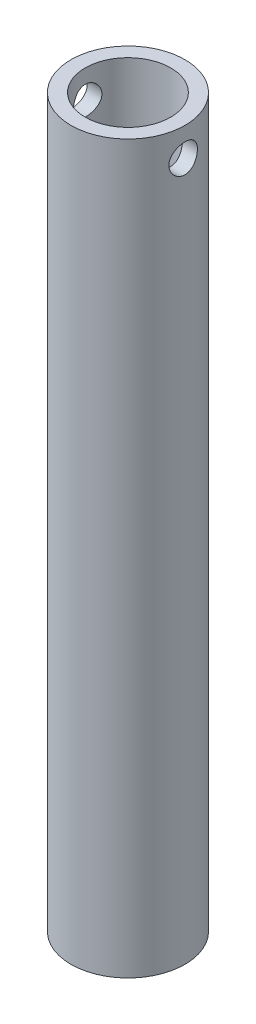
ISO-10303-21;
HEADER;
FILE_DESCRIPTION(('STEP AP214'),'2;1');
FILE_NAME('part.step','',(''),(''),'','','');
FILE_SCHEMA(('AUTOMOTIVE_DESIGN { 1 0 10303 214 1 1 1 1 }'));
ENDSEC;
DATA;
#1=APPLICATION_CONTEXT('core data for automotive mechanical design processes');
#2=APPLICATION_PROTOCOL_DEFINITION('international standard','automotive_design',2000,#1);
#3=PRODUCT_CONTEXT('',#1,'mechanical');
#4=PRODUCT('Part','Part','',(#3));
#5=PRODUCT_RELATED_PRODUCT_CATEGORY('part','',(#4));
#6=PRODUCT_DEFINITION_FORMATION('','',#4);
#7=PRODUCT_DEFINITION_CONTEXT('part definition',#1,'design');
#8=PRODUCT_DEFINITION('design','',#6,#7);
#9=PRODUCT_DEFINITION_SHAPE('','',#8);
#10=(LENGTH_UNIT() NAMED_UNIT(*) SI_UNIT(.MILLI.,.METRE.));
#11=(NAMED_UNIT(*) PLANE_ANGLE_UNIT() SI_UNIT($,.RADIAN.));
#12=(NAMED_UNIT(*) SI_UNIT($,.STERADIAN.) SOLID_ANGLE_UNIT());
#13=UNCERTAINTY_MEASURE_WITH_UNIT(LENGTH_MEASURE(1.E-05),#10,'distance_accuracy_value','');
#14=(GEOMETRIC_REPRESENTATION_CONTEXT(3) GLOBAL_UNCERTAINTY_ASSIGNED_CONTEXT((#13)) GLOBAL_UNIT_ASSIGNED_CONTEXT((#10,
#11,#12)) REPRESENTATION_CONTEXT('',''));
#15=CARTESIAN_POINT('',(0.,0.,0.));
#16=DIRECTION('',(0.,0.,1.));
#17=DIRECTION('',(1.,0.,0.));
#18=AXIS2_PLACEMENT_3D('',#15,#16,#17);
#19=CARTESIAN_POINT('',(0.,161.925,0.));
#20=DIRECTION('',(0.,1.,0.));
#21=DIRECTION('',(0.,0.,1.));
#22=AXIS2_PLACEMENT_3D('',#19,#20,#21);
#23=PLANE('',#22);
#24=CARTESIAN_POINT('',(0.,161.925,0.));
#25=DIRECTION('',(0.,1.,0.));
#26=DIRECTION('',(0.,0.,1.));
#27=AXIS2_PLACEMENT_3D('',#24,#25,#26);
#28=CIRCLE('',#27,12.7);
#29=CARTESIAN_POINT('',(0.,161.925,12.7));
#30=VERTEX_POINT('',#29);
#31=EDGE_CURVE('E10',#30,#30,#28,.T.);
#32=ORIENTED_EDGE('',*,*,#31,.T.);
#33=EDGE_LOOP('',(#32));
#34=FACE_BOUND('',#33,.T.);
#35=CARTESIAN_POINT('',(0.,161.925,0.));
#36=DIRECTION('',(0.,1.,0.));
#37=DIRECTION('',(0.,0.,1.));
#38=AXIS2_PLACEMENT_3D('',#35,#36,#37);
#39=CIRCLE('',#38,9.525);
#40=CARTESIAN_POINT('',(0.,161.925,9.525));
#41=VERTEX_POINT('',#40);
#42=EDGE_CURVE('E50',#41,#41,#39,.T.);
#43=ORIENTED_EDGE('',*,*,#42,.F.);
#44=EDGE_LOOP('',(#43));
#45=FACE_BOUND('',#44,.T.);
#46=ADVANCED_FACE('F32',(#34,#45),#23,.T.);
#47=CARTESIAN_POINT('',(0.,0.,0.));
#48=DIRECTION('',(0.,1.,0.));
#49=DIRECTION('',(0.,0.,1.));
#50=AXIS2_PLACEMENT_3D('',#47,#48,#49);
#51=PLANE('',#50);
#52=CARTESIAN_POINT('',(0.,0.,0.));
#53=DIRECTION('',(0.,1.,0.));
#54=DIRECTION('',(0.,0.,1.));
#55=AXIS2_PLACEMENT_3D('',#52,#53,#54);
#56=CIRCLE('',#55,12.7);
#57=CARTESIAN_POINT('',(0.,0.,12.7));
#58=VERTEX_POINT('',#57);
#59=EDGE_CURVE('E45',#58,#58,#56,.T.);
#60=ORIENTED_EDGE('',*,*,#59,.F.);
#61=EDGE_LOOP('',(#60));
#62=FACE_BOUND('',#61,.T.);
#63=CARTESIAN_POINT('',(0.,0.,0.));
#64=DIRECTION('',(0.,1.,0.));
#65=DIRECTION('',(0.,0.,1.));
#66=AXIS2_PLACEMENT_3D('',#63,#64,#65);
#67=CIRCLE('',#66,9.525);
#68=CARTESIAN_POINT('',(0.,0.,9.525));
#69=VERTEX_POINT('',#68);
#70=EDGE_CURVE('E53',#69,#69,#67,.T.);
#71=ORIENTED_EDGE('',*,*,#70,.T.);
#72=EDGE_LOOP('',(#71));
#73=FACE_BOUND('',#72,.T.);
#74=ADVANCED_FACE('F86',(#62,#73),#51,.F.);
#75=CARTESIAN_POINT('',(0.,161.925,0.));
#76=DIRECTION('',(0.,-1.,0.));
#77=DIRECTION('',(0.,0.,-1.));
#78=AXIS2_PLACEMENT_3D('',#75,#76,#77);
#79=CYLINDRICAL_SURFACE('',#78,12.7);
#80=CARTESIAN_POINT('',(-12.7,152.4,0.));
#81=CARTESIAN_POINT('',(-12.6999970338729,152.400004922812,-0.175421054350931));
#82=CARTESIAN_POINT('',(-12.6963292371237,152.414587115805,-0.350897100741782));
#83=CARTESIAN_POINT('',(-12.6820530760661,152.472443236933,-0.696820051980961));
#84=CARTESIAN_POINT('',(-12.6714407780562,152.515733426855,-0.867264049209733));
#85=CARTESIAN_POINT('',(-12.6444507573613,152.629529753161,-1.19807751278646));
#86=CARTESIAN_POINT('',(-12.6280799601569,152.700003207281,-1.35845880926017));
#87=CARTESIAN_POINT('',(-12.591316443928,152.866050608928,-1.66512267919771));
#88=CARTESIAN_POINT('',(-12.5709235892463,152.961625403118,-1.81140477687155));
#89=CARTESIAN_POINT('',(-12.5278602543575,153.177241671435,-2.08873074612027));
#90=CARTESIAN_POINT('',(-12.5051546346353,153.297702833663,-2.2194428772959));
#91=CARTESIAN_POINT('',(-12.4602582924963,153.558773833724,-2.45903522924702));
#92=CARTESIAN_POINT('',(-12.4380676284689,153.699385943571,-2.56791298487579));
#93=CARTESIAN_POINT('',(-12.3963594189446,153.999343229927,-2.76230618225783));
#94=CARTESIAN_POINT('',(-12.3768864828385,154.158935671878,-2.84745052370821));
#95=CARTESIAN_POINT('',(-12.343330973648,154.490734138014,-2.9895734564324));
#96=CARTESIAN_POINT('',(-12.3292475388652,154.662938140553,-3.04655655068163));
#97=CARTESIAN_POINT('',(-12.3084267567388,155.01142373786,-3.12960773790342));
#98=CARTESIAN_POINT('',(-12.3015478927701,155.187554529947,-3.15627230130284));
#99=CARTESIAN_POINT('',(-12.2954915053947,155.541913471049,-3.17978742389056));
#100=CARTESIAN_POINT('',(-12.2963127290578,155.720141274132,-3.176642833515));
#101=CARTESIAN_POINT('',(-12.3054365167726,156.069063459728,-3.14110481048737));
#102=CARTESIAN_POINT('',(-12.3135572669877,156.239835732102,-3.1094221534035));
#103=CARTESIAN_POINT('',(-12.3360753547043,156.573560891095,-3.01884119561133));
#104=CARTESIAN_POINT('',(-12.3504731393489,156.736513219745,-2.95994095604687));
#105=CARTESIAN_POINT('',(-12.3840899110031,157.051878801067,-2.81599106163371));
#106=CARTESIAN_POINT('',(-12.4033560981111,157.204169063621,-2.73068344564301));
#107=CARTESIAN_POINT('',(-12.4445122129068,157.492527935652,-2.53652078423163));
#108=CARTESIAN_POINT('',(-12.4664025994163,157.628593700076,-2.42766161831203));
#109=CARTESIAN_POINT('',(-12.5111061380944,157.884714319886,-2.18580424890856));
#110=CARTESIAN_POINT('',(-12.533927803951,158.004202003963,-2.05220624645105));
#111=CARTESIAN_POINT('',(-12.5773596047503,158.219184963215,-1.76659522538281));
#112=CARTESIAN_POINT('',(-12.5979696721291,158.314679505525,-1.6145816444818));
#113=CARTESIAN_POINT('',(-12.6347586626604,158.479173740842,-1.29564529770894));
#114=CARTESIAN_POINT('',(-12.6509221227036,158.548081303539,-1.12867311562491));
#115=CARTESIAN_POINT('',(-12.676884242985,158.656691630419,-0.785020883902428));
#116=CARTESIAN_POINT('',(-12.6866841206814,158.696399981085,-0.608342698201852));
#117=CARTESIAN_POINT('',(-12.6986347345774,158.744618513766,-0.255142937325549));
#118=CARTESIAN_POINT('',(-12.7009747992585,158.753901071859,-0.0787330573083703));
#119=CARTESIAN_POINT('',(-12.6982813685726,158.743122945649,0.273119584996531));
#120=CARTESIAN_POINT('',(-12.6932485369526,158.723064902742,0.448562432914398));
#121=CARTESIAN_POINT('',(-12.6764961338622,158.654811577238,0.790816868910241));
#122=CARTESIAN_POINT('',(-12.6648767569325,158.607037658974,0.957717835150525));
#123=CARTESIAN_POINT('',(-12.6362609570897,158.485190005473,1.28112793569116));
#124=CARTESIAN_POINT('',(-12.6192639911647,158.411113614204,1.43763601861911));
#125=CARTESIAN_POINT('',(-12.5813250177716,158.237266860549,1.73889063454314));
#126=CARTESIAN_POINT('',(-12.5603183592593,158.137063895427,1.88337918521904));
#127=CARTESIAN_POINT('',(-12.5167921111412,157.914361359713,2.15376466554501));
#128=CARTESIAN_POINT('',(-12.4942722608556,157.791857941143,2.27965837982672));
#129=CARTESIAN_POINT('',(-12.4495762556412,157.524445849547,2.51246336908675));
#130=CARTESIAN_POINT('',(-12.4274221051899,157.379061028651,2.6188328531313));
#131=CARTESIAN_POINT('',(-12.3865825924258,157.072049257042,2.80566443991221));
#132=CARTESIAN_POINT('',(-12.3678970761538,156.910423027713,2.88612769264177));
#133=CARTESIAN_POINT('',(-12.3363163381503,156.576382887573,3.0182638402854));
#134=CARTESIAN_POINT('',(-12.3233869021911,156.404039853404,3.07010730622842));
#135=CARTESIAN_POINT('',(-12.3047494152553,156.052711266541,3.1439816468797));
#136=CARTESIAN_POINT('',(-12.299039785006,155.873727175344,3.16601904149253));
#137=CARTESIAN_POINT('',(-12.2956087422145,155.51971049948,3.17931501621074));
#138=CARTESIAN_POINT('',(-12.2976625750886,155.344712095613,3.17143955029538));
#139=CARTESIAN_POINT('',(-12.3090074061494,154.998623435624,3.1271152390873));
#140=CARTESIAN_POINT('',(-12.3182982588945,154.827533101033,3.09066696801937));
#141=CARTESIAN_POINT('',(-12.3429450180984,154.495058761656,2.99070462615689));
#142=CARTESIAN_POINT('',(-12.3582644892528,154.333623037245,2.92735297324092));
#143=CARTESIAN_POINT('',(-12.3932474960913,154.023556606586,2.77551073379659));
#144=CARTESIAN_POINT('',(-12.4129116342002,153.874927680087,2.68701666057214));
#145=CARTESIAN_POINT('',(-12.4550092586011,153.590509368613,2.48468673461549));
#146=CARTESIAN_POINT('',(-12.4775016056118,153.455156061253,2.37025002816432));
#147=CARTESIAN_POINT('',(-12.5223699100401,153.205292088516,2.12045416901819));
#148=CARTESIAN_POINT('',(-12.5447458385544,153.090786379594,1.98509005500273));
#149=CARTESIAN_POINT('',(-12.5873437112106,152.883846063538,1.69432305852049));
#150=CARTESIAN_POINT('',(-12.6075193062447,152.791848734395,1.53860166056968));
#151=CARTESIAN_POINT('',(-12.6429542453062,152.635484536776,1.21341315929717));
#152=CARTESIAN_POINT('',(-12.6582171100619,152.571097869961,1.04395600927443));
#153=CARTESIAN_POINT('',(-12.6798505941374,152.481339625802,0.729001702698686));
#154=CARTESIAN_POINT('',(-12.6873547169486,152.450903202204,0.58500469508875));
#155=CARTESIAN_POINT('',(-12.6974304774096,152.410232086,0.29401785141847));
#156=CARTESIAN_POINT('',(-12.7000024860439,152.39999587397,0.147028241296873));
#157=CARTESIAN_POINT('',(-12.7,152.4,0.));
#158=B_SPLINE_CURVE_WITH_KNOTS('',3,(#80,#81,#82,#83,#84,#85,#86,#87,#88,#89,#90,#91,#92,#93,
#94,#95,#96,#97,#98,#99,#100,#101,#102,#103,#104,#105,#106,#107,#108,#109,#110,#111,#112,#113,
#114,#115,#116,#117,#118,#119,#120,#121,#122,#123,#124,#125,#126,#127,#128,#129,#130,#131,#132,
#133,#134,#135,#136,#137,#138,#139,#140,#141,#142,#143,#144,#145,#146,#147,#148,#149,#150,#151,
#152,#153,#154,#155,#156,#157),.UNSPECIFIED.,.T.,.F.,(4,2,2,2,2,2,2,2,2,2,2,2,2,2,2,2,2,2,2,2,2,
2,2,2,2,2,2,2,2,2,2,2,2,2,2,2,2,2,4),(0.,0.525724358065498,1.05174676993359,1.57713870983893,
2.10254837335841,2.63767221675278,3.17285644277796,3.7159913730529,4.25903942808498,
4.79120824630598,5.3232904734557,5.84247618671886,6.36169889010144,6.8861628400674,
7.41071862276906,7.95023177058124,8.48976139571985,9.0311441807632,9.57242335981323,
10.09985087283,10.6272309069567,11.1467958106174,11.6664131950588,12.1952509368702,
12.7241800170733,13.266092111565,13.8079801469349,14.34660272276,14.885107458967,
15.4081433519175,15.9311687337377,16.4510804786766,16.971064359066,17.5046127008448,
18.0382877269755,18.5816279265762,19.1245778677202,19.5652441424438,20.005877269746),.UNSPECIFIED.);
#159=CARTESIAN_POINT('',(-12.7,152.4,0.));
#160=VERTEX_POINT('',#159);
#161=EDGE_CURVE('E76',#160,#160,#158,.T.);
#162=ORIENTED_EDGE('',*,*,#161,.T.);
#163=EDGE_LOOP('',(#162));
#164=FACE_BOUND('',#163,.T.);
#165=CARTESIAN_POINT('',(12.2967221242086,155.575,-3.175));
#166=CARTESIAN_POINT('',(12.2967254711158,155.399675546323,-3.1749950198132));
#167=CARTESIAN_POINT('',(12.3005126863854,155.224295978678,-3.16042833178201));
#168=CARTESIAN_POINT('',(12.3152136473056,154.87857317572,-3.10263936933901));
#169=CARTESIAN_POINT('',(12.3261315404947,154.708232931825,-3.05940041756247));
#170=CARTESIAN_POINT('',(12.3537818023711,154.377639506502,-2.94575382353269));
#171=CARTESIAN_POINT('',(12.3705066621688,154.21737361266,-2.8753812543752));
#172=CARTESIAN_POINT('',(12.4078770387652,153.910905217274,-2.70957184940195));
#173=CARTESIAN_POINT('',(12.4285227220068,153.764703313158,-2.61413394947206));
#174=CARTESIAN_POINT('',(12.4719170977164,153.487295710517,-2.39865970268607));
#175=CARTESIAN_POINT('',(12.4946993898125,153.356445127555,-2.27817284738413));
#176=CARTESIAN_POINT('',(12.5395085190442,153.116583029162,-2.01699122140783));
#177=CARTESIAN_POINT('',(12.5615352853931,153.00757355546,-1.87629456360899));
#178=CARTESIAN_POINT('',(12.6027232771114,152.813035156108,-1.57625440537027));
#179=CARTESIAN_POINT('',(12.6218402299875,152.727855087035,-1.4166781117678));
#180=CARTESIAN_POINT('',(12.65467131146,152.585661751926,-1.08491424405179));
#181=CARTESIAN_POINT('',(12.6683862371462,152.528644330067,-0.912728534955745));
#182=CARTESIAN_POINT('',(12.6886304373719,152.445532250085,-0.564335623617766));
#183=CARTESIAN_POINT('',(12.6952996518228,152.418834551705,-0.388280553827183));
#184=CARTESIAN_POINT('',(12.7011886451627,152.39522685832,-0.0340726004637068));
#185=CARTESIAN_POINT('',(12.7004095254281,152.398312459294,0.144079969063354));
#186=CARTESIAN_POINT('',(12.6915938059099,152.433750059818,0.493243384772338));
#187=CARTESIAN_POINT('',(12.6837186297291,152.465451132818,0.664324984533399));
#188=CARTESIAN_POINT('',(12.6617836238657,152.556173512962,0.998658935538464));
#189=CARTESIAN_POINT('',(12.6477234649603,152.615196274429,1.16191086950115));
#190=CARTESIAN_POINT('',(12.6147513732012,152.759413264773,1.47766628361824));
#191=CARTESIAN_POINT('',(12.5957967501266,152.84483914672,1.63005931850867));
#192=CARTESIAN_POINT('',(12.5550917783831,153.039261712478,1.91857510093107));
#193=CARTESIAN_POINT('',(12.5333409435886,153.148262497072,2.05469501139649));
#194=CARTESIAN_POINT('',(12.4887191648708,153.390230102318,2.31068256139474));
#195=CARTESIAN_POINT('',(12.4658338379713,153.523765713282,2.43001063106375));
#196=CARTESIAN_POINT('',(12.4220610526701,153.809191966396,2.6446999936826));
#197=CARTESIAN_POINT('',(12.4011736876753,153.961083465954,2.74006016644614));
#198=CARTESIAN_POINT('',(12.3637103097323,154.279968343369,2.90445230964672));
#199=CARTESIAN_POINT('',(12.347155693206,154.447031377497,2.97335437513118));
#200=CARTESIAN_POINT('',(12.3205067298881,154.790883544458,3.08192684552051));
#201=CARTESIAN_POINT('',(12.3104110007027,154.96767058726,3.12160350580598));
#202=CARTESIAN_POINT('',(12.2981130212947,155.320948566943,3.16970364110572));
#203=CARTESIAN_POINT('',(12.2957093300071,155.497323997543,3.17892490187728));
#204=CARTESIAN_POINT('',(12.2985192607316,155.849093859463,3.16803657795425));
#205=CARTESIAN_POINT('',(12.3037321815428,156.024488379596,3.14792969326924));
#206=CARTESIAN_POINT('',(12.3209949412092,156.366355116485,3.07965533920158));
#207=CARTESIAN_POINT('',(12.3329315220802,156.532926362743,3.03195236671801));
#208=CARTESIAN_POINT('',(12.3621891219376,156.855707951474,2.91035496372148));
#209=CARTESIAN_POINT('',(12.3795107787294,157.011917064001,2.83645743059487));
#210=CARTESIAN_POINT('',(12.418010941113,157.312920422891,2.66289874827947));
#211=CARTESIAN_POINT('',(12.439258441312,157.457430626855,2.56276062737125));
#212=CARTESIAN_POINT('',(12.4830469550031,157.727889220758,2.34016643006687));
#213=CARTESIAN_POINT('',(12.5055881806495,157.853834554146,2.21770668600725));
#214=CARTESIAN_POINT('',(12.5501070185035,158.086820024065,1.95028413912649));
#215=CARTESIAN_POINT('',(12.5720564161859,158.193308279437,1.80483494928779));
#216=CARTESIAN_POINT('',(12.6123346509939,158.380348551028,1.49765601755557));
#217=CARTESIAN_POINT('',(12.6306636769502,158.460901920092,1.33592712544033));
#218=CARTESIAN_POINT('',(12.6615204698767,158.59308646385,1.0018972904962));
#219=CARTESIAN_POINT('',(12.6740898412846,158.644925641161,0.829682684763512));
#220=CARTESIAN_POINT('',(12.6921932261265,158.718834624953,0.478630489012201));
#221=CARTESIAN_POINT('',(12.6977285972965,158.740910176599,0.299794184005929));
#222=CARTESIAN_POINT('',(12.7010848787296,158.754342096902,-0.0542401964575578));
#223=CARTESIAN_POINT('',(12.6991103294396,158.746512926378,-0.229405900617125));
#224=CARTESIAN_POINT('',(12.6881222125238,158.70222314834,-0.57584180111684));
#225=CARTESIAN_POINT('',(12.6791088542401,158.665763392333,-0.747112113154457));
#226=CARTESIAN_POINT('',(12.655087493111,158.565684202227,-1.08004303817217));
#227=CARTESIAN_POINT('',(12.640112022951,158.502212035727,-1.24175042029425));
#228=CARTESIAN_POINT('',(12.6057434230086,158.350043411613,-1.55231164340717));
#229=CARTESIAN_POINT('',(12.5863497364056,158.261343774271,-1.7011638610184));
#230=CARTESIAN_POINT('',(12.5446551773491,158.058754132062,-1.985651122744));
#231=CARTESIAN_POINT('',(12.5222957878978,157.94431154628,-2.12088408784723));
#232=CARTESIAN_POINT('',(12.4774531075658,157.694557444972,-2.37050268936839));
#233=CARTESIAN_POINT('',(12.4549697867118,157.559240646347,-2.48488303211818));
#234=CARTESIAN_POINT('',(12.4119473580947,157.268540509948,-2.69164443404807));
#235=CARTESIAN_POINT('',(12.3914523466269,157.112829908315,-2.78357526664701));
#236=CARTESIAN_POINT('',(12.3553205869608,156.787673819647,-2.93981789665887));
#237=CARTESIAN_POINT('',(12.3396803064045,156.618238432652,-3.00414978846309));
#238=CARTESIAN_POINT('',(12.3174731028359,156.303417987423,-3.09379152821294));
#239=CARTESIAN_POINT('',(12.3097500503611,156.159539203074,-3.12417831664509));
#240=CARTESIAN_POINT('',(12.2993733749982,155.868786340932,-3.16478377891537));
#241=CARTESIAN_POINT('',(12.2967193196792,155.721912519724,-3.1750041731303));
#242=CARTESIAN_POINT('',(12.2967221242086,155.575,-3.175));
#243=B_SPLINE_CURVE_WITH_KNOTS('',3,(#165,#166,#167,#168,#169,#170,#171,#172,#173,#174,#175,
#176,#177,#178,#179,#180,#181,#182,#183,#184,#185,#186,#187,#188,#189,#190,#191,#192,#193,#194,
#195,#196,#197,#198,#199,#200,#201,#202,#203,#204,#205,#206,#207,#208,#209,#210,#211,#212,#213,
#214,#215,#216,#217,#218,#219,#220,#221,#222,#223,#224,#225,#226,#227,#228,#229,#230,#231,#232,
#233,#234,#235,#236,#237,#238,#239,#240,#241,#242),.UNSPECIFIED.,.T.,.F.,(4,2,2,2,2,2,2,2,2,2,2,
2,2,2,2,2,2,2,2,2,2,2,2,2,2,2,2,2,2,2,2,2,2,2,2,2,2,2,4),(0.,0.525433851004907,1.05117359161441,
1.57623602350084,2.10132074979461,2.63682421825082,3.1723777227943,3.71540400425359,
4.25835013005809,4.79029713764091,5.32216548805846,5.84223193614963,6.36232607040479,
6.88711950303145,7.41200429545521,7.95109492546329,8.4902107462375,9.03194068650673,
9.57355464164526,10.1008633995054,10.6281236152971,11.1467570436797,11.6654519221148,
12.1943221424741,12.7232793399029,13.2654717033224,13.8076357797011,14.3458193247108,
14.8838989712076,15.4074297658815,15.9309449907505,16.4516419323711,16.9724045329363,
17.5056431266551,18.0390169009448,18.5823412615974,19.1252693614627,19.5655924052587,
20.0058778838705),.UNSPECIFIED.);
#244=CARTESIAN_POINT('',(12.2967221242086,155.575,-3.175));
#245=VERTEX_POINT('',#244);
#246=EDGE_CURVE('E72',#245,#245,#243,.T.);
#247=ORIENTED_EDGE('',*,*,#246,.T.);
#248=EDGE_LOOP('',(#247));
#249=FACE_BOUND('',#248,.T.);
#250=ORIENTED_EDGE('',*,*,#31,.F.);
#251=EDGE_LOOP('',(#250));
#252=FACE_BOUND('',#251,.T.);
#253=ORIENTED_EDGE('',*,*,#59,.T.);
#254=EDGE_LOOP('',(#253));
#255=FACE_BOUND('',#254,.T.);
#256=ADVANCED_FACE('F34',(#164,#249,#252,#255),#79,.T.);
#257=CARTESIAN_POINT('',(0.,161.925,0.));
#258=DIRECTION('',(0.,-1.,0.));
#259=DIRECTION('',(0.,0.,-1.));
#260=AXIS2_PLACEMENT_3D('',#257,#258,#259);
#261=CYLINDRICAL_SURFACE('',#260,9.525);
#262=CARTESIAN_POINT('',(-8.98025612106915,155.575,-3.175));
#263=CARTESIAN_POINT('',(-8.98025555134128,155.747936455105,-3.17500081898399));
#264=CARTESIAN_POINT('',(-8.98530617498472,155.92086798944,-3.16082293820153));
#265=CARTESIAN_POINT('',(-9.00485797707984,156.261607786657,-3.10467734311196));
#266=CARTESIAN_POINT('',(-9.01936071226449,156.429415200845,-3.06270505113466));
#267=CARTESIAN_POINT('',(-9.05599546711913,156.754915385266,-2.95260866704957));
#268=CARTESIAN_POINT('',(-9.07811252608946,156.912627275981,-2.8845358279553));
#269=CARTESIAN_POINT('',(-9.12746212382781,157.21444315414,-2.72434567030138));
#270=CARTESIAN_POINT('',(-9.15469579088969,157.358544129608,-2.63222304663107));
#271=CARTESIAN_POINT('',(-9.21240503868728,157.634685880424,-2.42268738995613));
#272=CARTESIAN_POINT('',(-9.24296141131745,157.766116486033,-2.30449228387489));
#273=CARTESIAN_POINT('',(-9.30319020743184,158.007706593888,-2.0478358434057));
#274=CARTESIAN_POINT('',(-9.33286248831953,158.117862680274,-1.90937126079128));
#275=CARTESIAN_POINT('',(-9.38891527476712,158.316545499021,-1.61164431278889));
#276=CARTESIAN_POINT('',(-9.41518969452598,158.404432906712,-1.45193356813785));
#277=CARTESIAN_POINT('',(-9.46053437997871,158.55185328278,-1.1189691329852));
#278=CARTESIAN_POINT('',(-9.47960658694531,158.611393892837,-0.945719107056871));
#279=CARTESIAN_POINT('',(-9.50782564496303,158.698361338458,-0.596991495351317));
#280=CARTESIAN_POINT('',(-9.5172947441875,158.726833441866,-0.421801146658148));
#281=CARTESIAN_POINT('',(-9.52638456092937,158.75417923142,-0.0688907525664608));
#282=CARTESIAN_POINT('',(-9.52600781684693,158.753060546496,0.108828629001892));
#283=CARTESIAN_POINT('',(-9.51566675789472,158.721919491753,0.454353660740383));
#284=CARTESIAN_POINT('',(-9.50607905597497,158.693032472093,0.622274754278533));
#285=CARTESIAN_POINT('',(-9.47886621303647,158.609052285387,0.950732918260416));
#286=CARTESIAN_POINT('',(-9.46124052729002,158.553957342239,1.11126948744903));
#287=CARTESIAN_POINT('',(-9.41945253180987,158.418462317553,1.42288410762328));
#288=CARTESIAN_POINT('',(-9.39520735013749,158.337739145115,1.5738101015761));
#289=CARTESIAN_POINT('',(-9.34270397898567,158.1535454352,1.86030973354927));
#290=CARTESIAN_POINT('',(-9.31444467439657,158.050068572435,1.99587908667347));
#291=CARTESIAN_POINT('',(-9.25532159123421,157.817583800765,2.25457025130041));
#292=CARTESIAN_POINT('',(-9.22439783161187,157.687603223853,2.37680549868224));
#293=CARTESIAN_POINT('',(-9.1645528941526,157.408725295818,2.5980302992242));
#294=CARTESIAN_POINT('',(-9.13563202542329,157.259825034813,2.69701626991891));
#295=CARTESIAN_POINT('',(-9.08273917259531,156.944524738709,2.87016016973849));
#296=CARTESIAN_POINT('',(-9.05884361979074,156.777905483066,2.94394402199775));
#297=CARTESIAN_POINT('',(-9.01959241367421,156.433610823369,3.06210713863014));
#298=CARTESIAN_POINT('',(-9.00423318171519,156.25594008717,3.10649872649829));
#299=CARTESIAN_POINT('',(-8.98460345301982,155.903173221568,3.16281207065963));
#300=CARTESIAN_POINT('',(-8.9798639401205,155.728322576423,3.17610837823673));
#301=CARTESIAN_POINT('',(-8.9806993378791,155.378860726563,3.17374726853835));
#302=CARTESIAN_POINT('',(-8.98627237514011,155.204249484124,3.15809511009497));
#303=CARTESIAN_POINT('',(-9.00663737436701,154.866476633865,3.09951644367858));
#304=CARTESIAN_POINT('',(-9.02110608274668,154.703127759271,3.05754530088867));
#305=CARTESIAN_POINT('',(-9.05727657905498,154.385824050191,2.94866651362947));
#306=CARTESIAN_POINT('',(-9.07897964918116,154.231870886699,2.88175444845385));
#307=CARTESIAN_POINT('',(-9.12802586366624,153.932317163811,2.72248103184611));
#308=CARTESIAN_POINT('',(-9.1555260648837,153.787136409612,2.62937980078822));
#309=CARTESIAN_POINT('',(-9.21276315720814,153.513961283682,2.42120937702025));
#310=CARTESIAN_POINT('',(-9.24250070609047,153.385971997251,2.30613370845863));
#311=CARTESIAN_POINT('',(-9.30259247675171,153.144448650512,2.05070616623353));
#312=CARTESIAN_POINT('',(-9.33290753359821,153.03190631169,1.90940458398561));
#313=CARTESIAN_POINT('',(-9.3893275387162,152.832066248045,1.6091766501958));
#314=CARTESIAN_POINT('',(-9.41543263651181,152.744767626559,1.45025092494494));
#315=CARTESIAN_POINT('',(-9.46036988448665,152.598691167064,1.12007606322252));
#316=CARTESIAN_POINT('',(-9.47924920264386,152.539727695055,0.948915816544785));
#317=CARTESIAN_POINT('',(-9.50781089409934,152.451664418959,0.598355629061085));
#318=CARTESIAN_POINT('',(-9.51749658708009,152.422553835129,0.418958686953577));
#319=CARTESIAN_POINT('',(-9.52632915775114,152.395992903602,0.0660886913556059));
#320=CARTESIAN_POINT('',(-9.52594996283969,152.397118833765,-0.107266498446081));
#321=CARTESIAN_POINT('',(-9.51586223949088,152.427486953365,-0.451202885375571));
#322=CARTESIAN_POINT('',(-9.50615446789103,152.456726861885,-0.621784306400523));
#323=CARTESIAN_POINT('',(-9.47867404980259,152.541548594779,-0.952633729196804));
#324=CARTESIAN_POINT('',(-9.46103195296646,152.596704633746,-1.11302251014812));
#325=CARTESIAN_POINT('',(-9.41949985236771,152.731398661233,-1.42233126423387));
#326=CARTESIAN_POINT('',(-9.39560871852452,152.810941060251,-1.57124915665223));
#327=CARTESIAN_POINT('',(-9.34294133528522,152.995533200924,-1.8593880017804));
#328=CARTESIAN_POINT('',(-9.31401720161866,153.101416826087,-1.99804734869542));
#329=CARTESIAN_POINT('',(-9.25490239414217,153.334267216921,-2.25609475841497));
#330=CARTESIAN_POINT('',(-9.22471131854583,153.461240709184,-2.37547664865809));
#331=CARTESIAN_POINT('',(-9.16505913446274,153.738609703989,-2.59633024304515));
#332=CARTESIAN_POINT('',(-9.13567286363902,153.889727497351,-2.69691791704334));
#333=CARTESIAN_POINT('',(-9.08241113800573,154.207636805416,-2.87119803998104));
#334=CARTESIAN_POINT('',(-9.05853424386966,154.374424210369,-2.94489751640183));
#335=CARTESIAN_POINT('',(-9.02021736105684,154.71127879125,-3.06020415454822));
#336=CARTESIAN_POINT('',(-9.00539959321553,154.880856936693,-3.10311136154972));
#337=CARTESIAN_POINT('',(-8.9854209273797,155.225292960232,-3.16050396647392));
#338=CARTESIAN_POINT('',(-8.98025669710439,155.400148995279,-3.17499917194918));
#339=CARTESIAN_POINT('',(-8.98025612106915,155.575,-3.175));
#340=B_SPLINE_CURVE_WITH_KNOTS('',3,(#262,#263,#264,#265,#266,#267,#268,#269,#270,#271,#272,
#273,#274,#275,#276,#277,#278,#279,#280,#281,#282,#283,#284,#285,#286,#287,#288,#289,#290,#291,
#292,#293,#294,#295,#296,#297,#298,#299,#300,#301,#302,#303,#304,#305,#306,#307,#308,#309,#310,
#311,#312,#313,#314,#315,#316,#317,#318,#319,#320,#321,#322,#323,#324,#325,#326,#327,#328,#329,
#330,#331,#332,#333,#334,#335,#336,#337,#338,#339),.UNSPECIFIED.,.T.,.F.,(4,2,2,2,2,2,2,2,2,2,2,
2,2,2,2,2,2,2,2,2,2,2,2,2,2,2,2,2,2,2,2,2,2,2,2,2,2,2,4),(0.,0.518161856737954,1.03640907467316,
1.55364379231514,2.07099270263877,2.60671746332529,3.14252816921063,3.69231882006114,
4.24196117528058,4.77247962078669,5.30286129234891,5.81244090321183,6.32205505300828,
6.83836754181566,7.35482374200021,7.89559553605438,8.43645060268438,8.985016315017,
9.53335188057254,10.0569487508209,10.5804505128322,11.0859695656586,11.5915782629155,
12.1132237331089,12.6350231697725,13.1819271594322,13.7288117205517,14.2720628703095,
14.815117785382,15.3326491885149,15.8501386073106,16.3594083542837,16.868770261733,
17.3969527447801,17.9253040157361,18.4743376618726,19.023227709973,19.5473069861654,
20.0712053232972),.UNSPECIFIED.);
#341=CARTESIAN_POINT('',(-8.98025612106915,155.575,-3.175));
#342=VERTEX_POINT('',#341);
#343=EDGE_CURVE('E37',#342,#342,#340,.T.);
#344=ORIENTED_EDGE('',*,*,#343,.F.);
#345=EDGE_LOOP('',(#344));
#346=FACE_BOUND('',#345,.T.);
#347=CARTESIAN_POINT('',(8.98025612106915,155.575,-3.175));
#348=CARTESIAN_POINT('',(8.98025555134128,155.402063544895,-3.17500081898399));
#349=CARTESIAN_POINT('',(8.98530617498472,155.22913201056,-3.16082293820153));
#350=CARTESIAN_POINT('',(9.00485797707984,154.888392213343,-3.10467734311197));
#351=CARTESIAN_POINT('',(9.01936071226449,154.720584799155,-3.06270505113466));
#352=CARTESIAN_POINT('',(9.05599546711913,154.395084614734,-2.95260866704956));
#353=CARTESIAN_POINT('',(9.07811252608947,154.237372724019,-2.88453582795529));
#354=CARTESIAN_POINT('',(9.12746212382781,153.93555684586,-2.72434567030137));
#355=CARTESIAN_POINT('',(9.15469579088969,153.791455870392,-2.63222304663107));
#356=CARTESIAN_POINT('',(9.21240503868728,153.515314119576,-2.42268738995613));
#357=CARTESIAN_POINT('',(9.24296141131745,153.383883513967,-2.30449228387489));
#358=CARTESIAN_POINT('',(9.30319020743184,153.142293406112,-2.0478358434057));
#359=CARTESIAN_POINT('',(9.33286248831953,153.032137319726,-1.90937126079128));
#360=CARTESIAN_POINT('',(9.38891527476712,152.833454500979,-1.61164431278889));
#361=CARTESIAN_POINT('',(9.41518969452598,152.745567093288,-1.45193356813785));
#362=CARTESIAN_POINT('',(9.46053437997871,152.59814671722,-1.1189691329852));
#363=CARTESIAN_POINT('',(9.47960658694531,152.538606107163,-0.945719107056871));
#364=CARTESIAN_POINT('',(9.50782564496303,152.451638661542,-0.596991495351317));
#365=CARTESIAN_POINT('',(9.5172947441875,152.423166558134,-0.421801146658148));
#366=CARTESIAN_POINT('',(9.52638456092937,152.39582076858,-0.0688907525664608));
#367=CARTESIAN_POINT('',(9.52600781684693,152.396939453504,0.108828629001892));
#368=CARTESIAN_POINT('',(9.51566675789472,152.428080508247,0.454353660740383));
#369=CARTESIAN_POINT('',(9.50607905597497,152.456967527906,0.622274754278533));
#370=CARTESIAN_POINT('',(9.47886621303647,152.540947714613,0.950732918260416));
#371=CARTESIAN_POINT('',(9.46124052729002,152.596042657761,1.11126948744903));
#372=CARTESIAN_POINT('',(9.41945253180987,152.731537682447,1.42288410762328));
#373=CARTESIAN_POINT('',(9.39520735013749,152.812260854885,1.5738101015761));
#374=CARTESIAN_POINT('',(9.34270397898567,152.996454564799,1.86030973354927));
#375=CARTESIAN_POINT('',(9.31444467439657,153.099931427565,1.99587908667347));
#376=CARTESIAN_POINT('',(9.25532159123421,153.332416199235,2.25457025130041));
#377=CARTESIAN_POINT('',(9.22439783161187,153.462396776147,2.37680549868224));
#378=CARTESIAN_POINT('',(9.1645528941526,153.741274704182,2.5980302992242));
#379=CARTESIAN_POINT('',(9.13563202542329,153.890174965187,2.69701626991891));
#380=CARTESIAN_POINT('',(9.08273917259531,154.205475261291,2.87016016973849));
#381=CARTESIAN_POINT('',(9.05884361979074,154.372094516934,2.94394402199776));
#382=CARTESIAN_POINT('',(9.01959241367421,154.716389176631,3.06210713863014));
#383=CARTESIAN_POINT('',(9.00423318171519,154.89405991283,3.10649872649829));
#384=CARTESIAN_POINT('',(8.98460345301983,155.246826778432,3.16281207065963));
#385=CARTESIAN_POINT('',(8.9798639401205,155.421677423577,3.17610837823673));
#386=CARTESIAN_POINT('',(8.9806993378791,155.771139273437,3.17374726853835));
#387=CARTESIAN_POINT('',(8.98627237514011,155.945750515876,3.15809511009497));
#388=CARTESIAN_POINT('',(9.00663737436701,156.283523366135,3.09951644367858));
#389=CARTESIAN_POINT('',(9.02110608274668,156.446872240729,3.05754530088867));
#390=CARTESIAN_POINT('',(9.05727657905498,156.764175949809,2.94866651362947));
#391=CARTESIAN_POINT('',(9.07897964918116,156.918129113301,2.88175444845385));
#392=CARTESIAN_POINT('',(9.12802586366624,157.217682836189,2.72248103184611));
#393=CARTESIAN_POINT('',(9.1555260648837,157.362863590388,2.62937980078822));
#394=CARTESIAN_POINT('',(9.21276315720814,157.636038716318,2.42120937702025));
#395=CARTESIAN_POINT('',(9.24250070609047,157.764028002749,2.30613370845863));
#396=CARTESIAN_POINT('',(9.30259247675171,158.005551349488,2.05070616623353));
#397=CARTESIAN_POINT('',(9.33290753359821,158.11809368831,1.90940458398561));
#398=CARTESIAN_POINT('',(9.3893275387162,158.317933751955,1.6091766501958));
#399=CARTESIAN_POINT('',(9.41543263651181,158.405232373441,1.45025092494494));
#400=CARTESIAN_POINT('',(9.46036988448665,158.551308832936,1.12007606322252));
#401=CARTESIAN_POINT('',(9.47924920264386,158.610272304945,0.948915816544785));
#402=CARTESIAN_POINT('',(9.50781089409934,158.698335581041,0.598355629061085));
#403=CARTESIAN_POINT('',(9.51749658708009,158.727446164871,0.418958686953577));
#404=CARTESIAN_POINT('',(9.52632915775114,158.754007096398,0.0660886913556059));
#405=CARTESIAN_POINT('',(9.52594996283969,158.752881166235,-0.10726649844608));
#406=CARTESIAN_POINT('',(9.51586223949088,158.722513046635,-0.451202885375571));
#407=CARTESIAN_POINT('',(9.50615446789103,158.693273138115,-0.621784306400523));
#408=CARTESIAN_POINT('',(9.47867404980259,158.608451405221,-0.952633729196801));
#409=CARTESIAN_POINT('',(9.46103195296646,158.553295366254,-1.11302251014812));
#410=CARTESIAN_POINT('',(9.41949985236771,158.418601338767,-1.42233126423386));
#411=CARTESIAN_POINT('',(9.39560871852452,158.339058939749,-1.57124915665223));
#412=CARTESIAN_POINT('',(9.34294133528522,158.154466799076,-1.8593880017804));
#413=CARTESIAN_POINT('',(9.31401720161866,158.048583173913,-1.99804734869542));
#414=CARTESIAN_POINT('',(9.25490239414217,157.815732783079,-2.25609475841497));
#415=CARTESIAN_POINT('',(9.22471131854583,157.688759290816,-2.37547664865809));
#416=CARTESIAN_POINT('',(9.16505913446274,157.411390296011,-2.59633024304515));
#417=CARTESIAN_POINT('',(9.13567286363902,157.260272502649,-2.69691791704334));
#418=CARTESIAN_POINT('',(9.08241113800573,156.942363194584,-2.87119803998104));
#419=CARTESIAN_POINT('',(9.05853424386966,156.775575789631,-2.94489751640183));
#420=CARTESIAN_POINT('',(9.02021736105684,156.43872120875,-3.06020415454822));
#421=CARTESIAN_POINT('',(9.00539959321553,156.269143063307,-3.10311136154972));
#422=CARTESIAN_POINT('',(8.9854209273797,155.924707039768,-3.16050396647392));
#423=CARTESIAN_POINT('',(8.98025669710439,155.749851004721,-3.17499917194918));
#424=CARTESIAN_POINT('',(8.98025612106915,155.575,-3.175));
#425=B_SPLINE_CURVE_WITH_KNOTS('',3,(#347,#348,#349,#350,#351,#352,#353,#354,#355,#356,#357,
#358,#359,#360,#361,#362,#363,#364,#365,#366,#367,#368,#369,#370,#371,#372,#373,#374,#375,#376,
#377,#378,#379,#380,#381,#382,#383,#384,#385,#386,#387,#388,#389,#390,#391,#392,#393,#394,#395,
#396,#397,#398,#399,#400,#401,#402,#403,#404,#405,#406,#407,#408,#409,#410,#411,#412,#413,#414,
#415,#416,#417,#418,#419,#420,#421,#422,#423,#424),.UNSPECIFIED.,.T.,.F.,(4,2,2,2,2,2,2,2,2,2,2,
2,2,2,2,2,2,2,2,2,2,2,2,2,2,2,2,2,2,2,2,2,2,2,2,2,2,2,4),(0.,0.518161856737954,1.03640907467316,
1.55364379231514,2.07099270263877,2.60671746332529,3.14252816921063,3.69231882006113,
4.24196117528058,4.77247962078668,5.30286129234891,5.81244090321183,6.32205505300828,
6.83836754181566,7.35482374200021,7.89559553605437,8.43645060268438,8.98501631501702,
9.53335188057253,10.0569487508209,10.5804505128322,11.0859695656586,11.5915782629155,
12.1132237331089,12.6350231697725,13.1819271594322,13.7288117205516,14.2720628703095,
14.815117785382,15.3326491885149,15.8501386073105,16.3594083542836,16.868770261733,
17.3969527447801,17.9253040157361,18.4743376618726,19.023227709973,19.5473069861654,
20.0712053232972),.UNSPECIFIED.);
#426=CARTESIAN_POINT('',(8.98025612106915,155.575,-3.175));
#427=VERTEX_POINT('',#426);
#428=EDGE_CURVE('E55',#427,#427,#425,.T.);
#429=ORIENTED_EDGE('',*,*,#428,.F.);
#430=EDGE_LOOP('',(#429));
#431=FACE_BOUND('',#430,.T.);
#432=ORIENTED_EDGE('',*,*,#42,.T.);
#433=EDGE_LOOP('',(#432));
#434=FACE_BOUND('',#433,.T.);
#435=ORIENTED_EDGE('',*,*,#70,.F.);
#436=EDGE_LOOP('',(#435));
#437=FACE_BOUND('',#436,.T.);
#438=ADVANCED_FACE('F59',(#346,#431,#434,#437),#261,.F.);
#439=CARTESIAN_POINT('',(-12.7,155.575,0.));
#440=DIRECTION('',(1.,0.,0.));
#441=DIRECTION('',(0.,0.,-1.));
#442=AXIS2_PLACEMENT_3D('',#439,#440,#441);
#443=CYLINDRICAL_SURFACE('',#442,3.175);
#444=ORIENTED_EDGE('',*,*,#428,.T.);
#445=EDGE_LOOP('',(#444));
#446=FACE_BOUND('',#445,.T.);
#447=ORIENTED_EDGE('',*,*,#246,.F.);
#448=EDGE_LOOP('',(#447));
#449=FACE_BOUND('',#448,.T.);
#450=ADVANCED_FACE('F65',(#446,#449),#443,.F.);
#451=ORIENTED_EDGE('',*,*,#343,.T.);
#452=EDGE_LOOP('',(#451));
#453=FACE_BOUND('',#452,.T.);
#454=ORIENTED_EDGE('',*,*,#161,.F.);
#455=EDGE_LOOP('',(#454));
#456=FACE_BOUND('',#455,.T.);
#457=ADVANCED_FACE('F62',(#453,#456),#443,.F.);
#458=CLOSED_SHELL('',(#46,#74,#256,#438,#450,#457));
#459=MANIFOLD_SOLID_BREP('B2',#458);
#460=ADVANCED_BREP_SHAPE_REPRESENTATION('',(#18,#459),#14);
#461=SHAPE_DEFINITION_REPRESENTATION(#9,#460);
ENDSEC;
END-ISO-10303-21;
